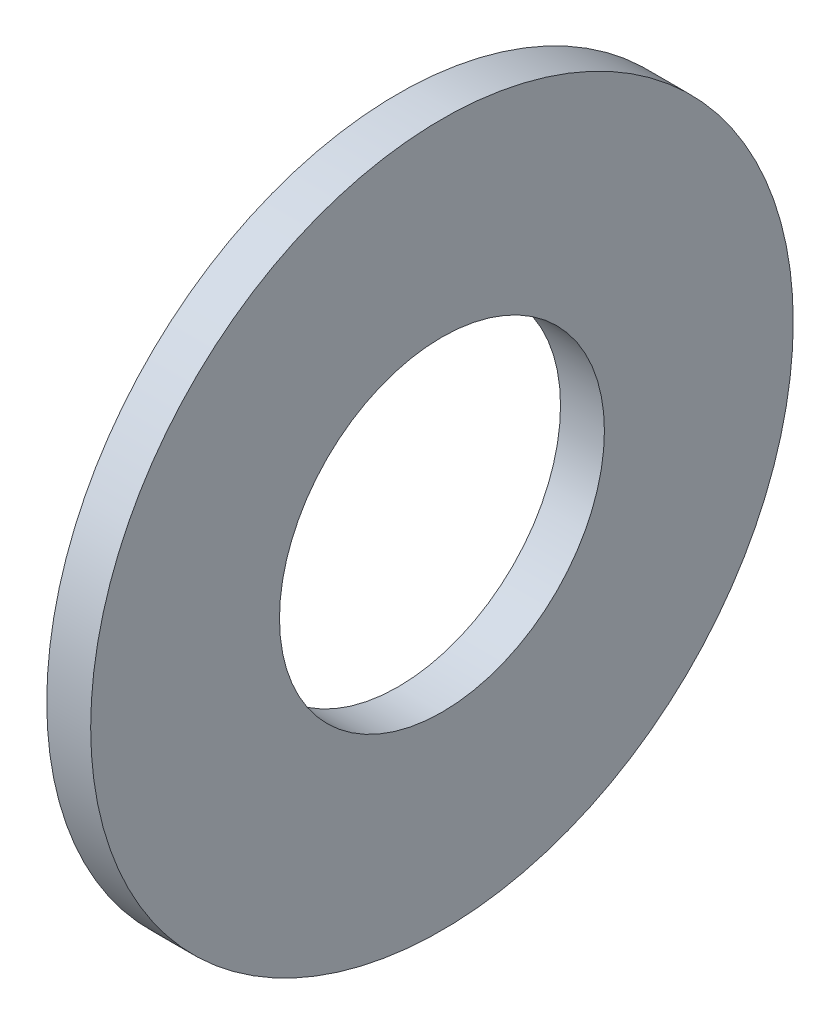
ISO-10303-21;
HEADER;
FILE_DESCRIPTION(('STEP AP214'),'2;1');
FILE_NAME('part.step','',(''),(''),'','','');
FILE_SCHEMA(('AUTOMOTIVE_DESIGN { 1 0 10303 214 1 1 1 1 }'));
ENDSEC;
DATA;
#1=APPLICATION_CONTEXT('core data for automotive mechanical design processes');
#2=APPLICATION_PROTOCOL_DEFINITION('international standard','automotive_design',2000,#1);
#3=PRODUCT_CONTEXT('',#1,'mechanical');
#4=PRODUCT('Part','Part','',(#3));
#5=PRODUCT_RELATED_PRODUCT_CATEGORY('part','',(#4));
#6=PRODUCT_DEFINITION_FORMATION('','',#4);
#7=PRODUCT_DEFINITION_CONTEXT('part definition',#1,'design');
#8=PRODUCT_DEFINITION('design','',#6,#7);
#9=PRODUCT_DEFINITION_SHAPE('','',#8);
#10=(LENGTH_UNIT() NAMED_UNIT(*) SI_UNIT(.MILLI.,.METRE.));
#11=(NAMED_UNIT(*) PLANE_ANGLE_UNIT() SI_UNIT($,.RADIAN.));
#12=(NAMED_UNIT(*) SI_UNIT($,.STERADIAN.) SOLID_ANGLE_UNIT());
#13=UNCERTAINTY_MEASURE_WITH_UNIT(LENGTH_MEASURE(1.E-05),#10,'distance_accuracy_value','');
#14=(GEOMETRIC_REPRESENTATION_CONTEXT(3) GLOBAL_UNCERTAINTY_ASSIGNED_CONTEXT((#13)) GLOBAL_UNIT_ASSIGNED_CONTEXT((#10,
#11,#12)) REPRESENTATION_CONTEXT('',''));
#15=CARTESIAN_POINT('',(0.,0.,0.));
#16=DIRECTION('',(0.,0.,1.));
#17=DIRECTION('',(1.,0.,0.));
#18=AXIS2_PLACEMENT_3D('',#15,#16,#17);
#19=CARTESIAN_POINT('',(-0.5,4.,0.));
#20=DIRECTION('',(1.,0.,0.));
#21=DIRECTION('',(0.,0.,-1.));
#22=AXIS2_PLACEMENT_3D('',#19,#20,#21);
#23=PLANE('',#22);
#24=CARTESIAN_POINT('',(-0.5,0.,0.));
#25=DIRECTION('',(-1.,0.,0.));
#26=DIRECTION('',(0.,0.,1.));
#27=AXIS2_PLACEMENT_3D('',#24,#25,#26);
#28=CIRCLE('',#27,4.);
#29=CARTESIAN_POINT('',(-0.5,0.,4.));
#30=VERTEX_POINT('',#29);
#31=EDGE_CURVE('E17',#30,#30,#28,.F.);
#32=ORIENTED_EDGE('',*,*,#31,.F.);
#33=EDGE_LOOP('',(#32));
#34=FACE_BOUND('',#33,.T.);
#35=CARTESIAN_POINT('',(-0.5,0.,0.));
#36=DIRECTION('',(-1.,0.,0.));
#37=DIRECTION('',(0.,0.,1.));
#38=AXIS2_PLACEMENT_3D('',#35,#36,#37);
#39=CIRCLE('',#38,1.85);
#40=CARTESIAN_POINT('',(-0.5,0.,1.85));
#41=VERTEX_POINT('',#40);
#42=EDGE_CURVE('E26',#41,#41,#39,.F.);
#43=ORIENTED_EDGE('',*,*,#42,.T.);
#44=EDGE_LOOP('',(#43));
#45=FACE_BOUND('',#44,.T.);
#46=ADVANCED_FACE('F14',(#34,#45),#23,.F.);
#47=CARTESIAN_POINT('',(-34.9249999999999,0.,0.));
#48=DIRECTION('',(-1.,0.,0.));
#49=DIRECTION('',(0.,0.,1.));
#50=AXIS2_PLACEMENT_3D('',#47,#48,#49);
#51=CYLINDRICAL_SURFACE('',#50,4.);
#52=ORIENTED_EDGE('',*,*,#31,.T.);
#53=EDGE_LOOP('',(#52));
#54=FACE_BOUND('',#53,.T.);
#55=CARTESIAN_POINT('',(0.,0.,0.));
#56=DIRECTION('',(-1.,0.,0.));
#57=DIRECTION('',(0.,0.,1.));
#58=AXIS2_PLACEMENT_3D('',#55,#56,#57);
#59=CIRCLE('',#58,4.);
#60=CARTESIAN_POINT('',(0.,0.,4.));
#61=VERTEX_POINT('',#60);
#62=EDGE_CURVE('E21',#61,#61,#59,.T.);
#63=ORIENTED_EDGE('',*,*,#62,.T.);
#64=EDGE_LOOP('',(#63));
#65=FACE_BOUND('',#64,.T.);
#66=ADVANCED_FACE('F34',(#54,#65),#51,.T.);
#67=CARTESIAN_POINT('',(-34.9249999999999,0.,0.));
#68=DIRECTION('',(-1.,0.,0.));
#69=DIRECTION('',(0.,0.,1.));
#70=AXIS2_PLACEMENT_3D('',#67,#68,#69);
#71=CYLINDRICAL_SURFACE('',#70,1.85);
#72=CARTESIAN_POINT('',(0.,0.,0.));
#73=DIRECTION('',(-1.,0.,0.));
#74=DIRECTION('',(0.,0.,1.));
#75=AXIS2_PLACEMENT_3D('',#72,#73,#74);
#76=CIRCLE('',#75,1.85);
#77=CARTESIAN_POINT('',(0.,0.,1.85));
#78=VERTEX_POINT('',#77);
#79=EDGE_CURVE('E10',#78,#78,#76,.F.);
#80=ORIENTED_EDGE('',*,*,#79,.T.);
#81=EDGE_LOOP('',(#80));
#82=FACE_BOUND('',#81,.T.);
#83=ORIENTED_EDGE('',*,*,#42,.F.);
#84=EDGE_LOOP('',(#83));
#85=FACE_BOUND('',#84,.T.);
#86=ADVANCED_FACE('F42',(#82,#85),#71,.F.);
#87=CARTESIAN_POINT('',(0.,1.85,0.));
#88=DIRECTION('',(-1.,0.,0.));
#89=DIRECTION('',(0.,0.,1.));
#90=AXIS2_PLACEMENT_3D('',#87,#88,#89);
#91=PLANE('',#90);
#92=ORIENTED_EDGE('',*,*,#79,.F.);
#93=EDGE_LOOP('',(#92));
#94=FACE_BOUND('',#93,.T.);
#95=ORIENTED_EDGE('',*,*,#62,.F.);
#96=EDGE_LOOP('',(#95));
#97=FACE_BOUND('',#96,.T.);
#98=ADVANCED_FACE('F43',(#94,#97),#91,.F.);
#99=CLOSED_SHELL('',(#46,#66,#86,#98));
#100=MANIFOLD_SOLID_BREP('B1',#99);
#101=ADVANCED_BREP_SHAPE_REPRESENTATION('',(#18,#100),#14);
#102=SHAPE_DEFINITION_REPRESENTATION(#9,#101);
ENDSEC;
END-ISO-10303-21;
